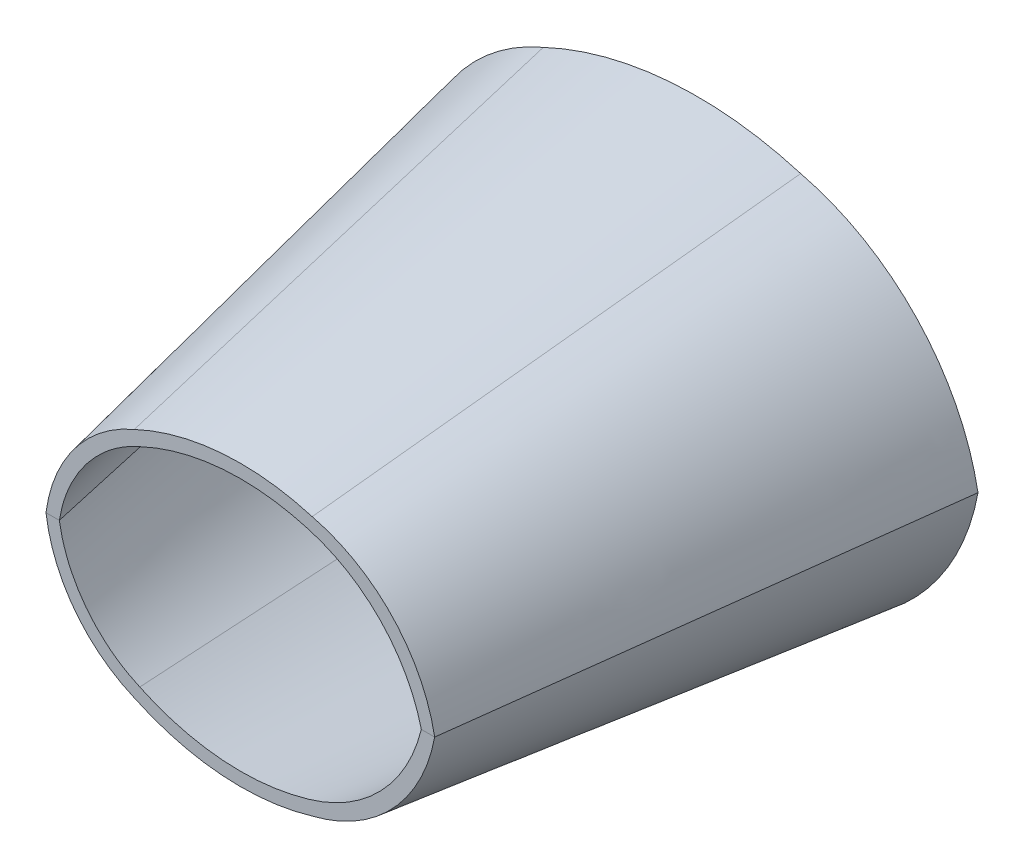
ISO-10303-21;
HEADER;
FILE_DESCRIPTION(('STEP AP214'),'2;1');
FILE_NAME('part.step','',(''),(''),'','','');
FILE_SCHEMA(('AUTOMOTIVE_DESIGN { 1 0 10303 214 1 1 1 1 }'));
ENDSEC;
DATA;
#1=APPLICATION_CONTEXT('core data for automotive mechanical design processes');
#2=APPLICATION_PROTOCOL_DEFINITION('international standard','automotive_design',2000,#1);
#3=PRODUCT_CONTEXT('',#1,'mechanical');
#4=PRODUCT('Part','Part','',(#3));
#5=PRODUCT_RELATED_PRODUCT_CATEGORY('part','',(#4));
#6=PRODUCT_DEFINITION_FORMATION('','',#4);
#7=PRODUCT_DEFINITION_CONTEXT('part definition',#1,'design');
#8=PRODUCT_DEFINITION('design','',#6,#7);
#9=PRODUCT_DEFINITION_SHAPE('','',#8);
#10=(LENGTH_UNIT() NAMED_UNIT(*) SI_UNIT(.MILLI.,.METRE.));
#11=(NAMED_UNIT(*) PLANE_ANGLE_UNIT() SI_UNIT($,.RADIAN.));
#12=(NAMED_UNIT(*) SI_UNIT($,.STERADIAN.) SOLID_ANGLE_UNIT());
#13=UNCERTAINTY_MEASURE_WITH_UNIT(LENGTH_MEASURE(1.E-05),#10,'distance_accuracy_value','');
#14=(GEOMETRIC_REPRESENTATION_CONTEXT(3) GLOBAL_UNCERTAINTY_ASSIGNED_CONTEXT((#13)) GLOBAL_UNIT_ASSIGNED_CONTEXT((#10,
#11,#12)) REPRESENTATION_CONTEXT('',''));
#15=CARTESIAN_POINT('',(0.,0.,0.));
#16=DIRECTION('',(0.,0.,1.));
#17=DIRECTION('',(1.,0.,0.));
#18=AXIS2_PLACEMENT_3D('',#15,#16,#17);
#19=CARTESIAN_POINT('',(-12.6687048152784,-8.00955853902853,0.));
#20=DIRECTION('',(0.,0.,-1.));
#21=DIRECTION('',(-1.,0.,0.));
#22=AXIS2_PLACEMENT_3D('',#19,#20,#21);
#23=PLANE('',#22);
#24=CARTESIAN_POINT('',(-12.6687048152784,-8.00955853902853,0.));
#25=DIRECTION('',(0.,0.,-1.));
#26=DIRECTION('',(-1.,0.,0.));
#27=AXIS2_PLACEMENT_3D('',#24,#25,#26);
#28=CIRCLE('',#27,38.1);
#29=CARTESIAN_POINT('',(-50.29,-1.988915,0.));
#30=VERTEX_POINT('',#29);
#31=CARTESIAN_POINT('',(-27.97978557,26.87855987,0.));
#32=VERTEX_POINT('',#31);
#33=EDGE_CURVE('E415',#30,#32,#28,.T.);
#34=ORIENTED_EDGE('',*,*,#33,.F.);
#35=DIRECTION('',(1.,0.,0.));
#36=VECTOR('',#35,1.);
#37=CARTESIAN_POINT('',(-53.99,-1.988915,0.));
#38=LINE('',#37,#36);
#39=CARTESIAN_POINT('',(-53.99,-1.9889151,0.));
#40=VERTEX_POINT('',#39);
#41=EDGE_CURVE('E12',#40,#30,#38,.T.);
#42=ORIENTED_EDGE('',*,*,#41,.F.);
#43=CARTESIAN_POINT('',(-13.7108054098462,-7.16178491606446,0.));
#44=DIRECTION('',(0.,0.,1.));
#45=DIRECTION('',(-1.,0.,0.));
#46=AXIS2_PLACEMENT_3D('',#43,#44,#45);
#47=CIRCLE('',#46,40.61);
#48=CARTESIAN_POINT('',(-29.4869285,30.25861113,0.));
#49=VERTEX_POINT('',#48);
#50=EDGE_CURVE('E220',#49,#40,#47,.T.);
#51=ORIENTED_EDGE('',*,*,#50,.F.);
#52=CARTESIAN_POINT('',(0.0239219679980442,-32.3996469423041,0.));
#53=DIRECTION('',(0.,0.,1.));
#54=DIRECTION('',(-1.,0.,0.));
#55=AXIS2_PLACEMENT_3D('',#52,#53,#54);
#56=CIRCLE('',#55,69.26);
#57=CARTESIAN_POINT('',(19.81935991,33.97119181,0.));
#58=VERTEX_POINT('',#57);
#59=EDGE_CURVE('E958',#58,#49,#56,.T.);
#60=ORIENTED_EDGE('',*,*,#59,.F.);
#61=CARTESIAN_POINT('',(9.06066667413897,-10.2179575352481,0.));
#62=DIRECTION('',(0.,0.,1.));
#63=DIRECTION('',(-1.,0.,0.));
#64=AXIS2_PLACEMENT_3D('',#61,#62,#63);
#65=CIRCLE('',#64,45.48);
#66=CARTESIAN_POINT('',(53.79,-1.98891504999999,0.));
#67=VERTEX_POINT('',#66);
#68=EDGE_CURVE('E915',#67,#58,#65,.T.);
#69=ORIENTED_EDGE('',*,*,#68,.F.);
#70=DIRECTION('',(1.,0.,0.));
#71=VECTOR('',#70,1.);
#72=CARTESIAN_POINT('',(50.09,-1.98891505,0.));
#73=LINE('',#72,#71);
#74=CARTESIAN_POINT('',(50.09,-1.98891505,0.));
#75=VERTEX_POINT('',#74);
#76=EDGE_CURVE('E874',#75,#67,#73,.T.);
#77=ORIENTED_EDGE('',*,*,#76,.F.);
#78=CARTESIAN_POINT('',(6.60314094344316,-12.6726170954129,0.));
#79=DIRECTION('',(0.,0.,-1.));
#80=DIRECTION('',(-1.,0.,0.));
#81=AXIS2_PLACEMENT_3D('',#78,#79,#80);
#82=CIRCLE('',#81,44.78);
#83=CARTESIAN_POINT('',(18.7964615473141,30.4455978823664,0.));
#84=VERTEX_POINT('',#83);
#85=EDGE_CURVE('E234',#84,#75,#82,.T.);
#86=ORIENTED_EDGE('',*,*,#85,.F.);
#87=CARTESIAN_POINT('',(0.0239231317043301,-32.399647752617,0.));
#88=DIRECTION('',(0.,0.,-1.));
#89=DIRECTION('',(-1.,0.,0.));
#90=AXIS2_PLACEMENT_3D('',#87,#88,#89);
#91=CIRCLE('',#90,65.56);
#92=EDGE_CURVE('E228',#32,#84,#91,.T.);
#93=ORIENTED_EDGE('',*,*,#92,.F.);
#94=EDGE_LOOP('',(#34,#42,#51,#60,#69,#77,#86,#93));
#95=FACE_BOUND('',#94,.T.);
#96=ADVANCED_FACE('F210',(#95),#23,.T.);
#97=CARTESIAN_POINT('',(-3.61942943832231,-6.1515091110409,92.59));
#98=DIRECTION('',(0.,0.,1.));
#99=DIRECTION('',(1.,0.,0.));
#100=AXIS2_PLACEMENT_3D('',#97,#98,#99);
#101=PLANE('',#100);
#102=CARTESIAN_POINT('',(-3.61942943832231,-6.1515091110409,92.59));
#103=DIRECTION('',(0.,0.,-1.));
#104=DIRECTION('',(1.,0.,0.));
#105=AXIS2_PLACEMENT_3D('',#102,#103,#104);
#106=CIRCLE('',#105,26.3217984327224);
#107=CARTESIAN_POINT('',(-29.61,-1.9889,92.59));
#108=VERTEX_POINT('',#107);
#109=CARTESIAN_POINT('',(-14.2002768194766,17.95,92.59));
#110=VERTEX_POINT('',#109);
#111=EDGE_CURVE('E495',#108,#110,#106,.T.);
#112=ORIENTED_EDGE('',*,*,#111,.T.);
#113=CARTESIAN_POINT('',(5.1428605077266,-23.0040899052184,92.59));
#114=DIRECTION('',(0.,0.,-1.));
#115=DIRECTION('',(1.,0.,0.));
#116=AXIS2_PLACEMENT_3D('',#113,#114,#115);
#117=CIRCLE('',#116,45.2923221045659);
#118=CARTESIAN_POINT('',(18.1166461409944,20.4115322582096,92.59));
#119=VERTEX_POINT('',#118);
#120=EDGE_CURVE('E664',#110,#119,#117,.T.);
#121=ORIENTED_EDGE('',*,*,#120,.T.);
#122=CARTESIAN_POINT('',(9.69295129625454,-9.38080114975129,92.59));
#123=DIRECTION('',(0.,0.,-1.));
#124=DIRECTION('',(1.,0.,0.));
#125=AXIS2_PLACEMENT_3D('',#122,#123,#124);
#126=CIRCLE('',#125,30.9400075828146);
#127=CARTESIAN_POINT('',(39.7369834260624,-1.9889,92.59));
#128=VERTEX_POINT('',#127);
#129=EDGE_CURVE('E663',#119,#128,#126,.T.);
#130=ORIENTED_EDGE('',*,*,#129,.T.);
#131=DIRECTION('',(1.,0.,0.));
#132=VECTOR('',#131,1.);
#133=CARTESIAN_POINT('',(39.7369834260624,-1.9889,92.59));
#134=LINE('',#133,#132);
#135=CARTESIAN_POINT('',(42.2937504675306,-1.9889,92.59));
#136=VERTEX_POINT('',#135);
#137=EDGE_CURVE('E420',#128,#136,#134,.T.);
#138=ORIENTED_EDGE('',*,*,#137,.T.);
#139=CARTESIAN_POINT('',(11.3901153445154,-7.68546373703139,92.59));
#140=DIRECTION('',(0.,0.,1.));
#141=DIRECTION('',(1.,0.,0.));
#142=AXIS2_PLACEMENT_3D('',#139,#140,#141);
#143=CIRCLE('',#142,31.4242820479088);
#144=CARTESIAN_POINT('',(18.82476412,22.8466750647576,92.59));
#145=VERTEX_POINT('',#144);
#146=EDGE_CURVE('E417',#136,#145,#143,.T.);
#147=ORIENTED_EDGE('',*,*,#146,.T.);
#148=CARTESIAN_POINT('',(5.1428605077266,-23.0040899052184,92.59));
#149=DIRECTION('',(0.,0.,1.));
#150=DIRECTION('',(1.,0.,0.));
#151=AXIS2_PLACEMENT_3D('',#148,#149,#150);
#152=CIRCLE('',#151,47.8485855045634);
#153=CARTESIAN_POINT('',(-15.248018320997,20.28215728,92.59));
#154=VERTEX_POINT('',#153);
#155=EDGE_CURVE('E421',#145,#154,#152,.T.);
#156=ORIENTED_EDGE('',*,*,#155,.T.);
#157=CARTESIAN_POINT('',(-4.33820298576542,-5.56733880887085,92.59));
#158=DIRECTION('',(0.,0.,1.));
#159=DIRECTION('',(1.,0.,0.));
#160=AXIS2_PLACEMENT_3D('',#157,#158,#159);
#161=CIRCLE('',#160,28.0574503242437);
#162=CARTESIAN_POINT('',(-32.1665211956136,-1.9889,92.59));
#163=VERTEX_POINT('',#162);
#164=EDGE_CURVE('E1071',#154,#163,#161,.T.);
#165=ORIENTED_EDGE('',*,*,#164,.T.);
#166=DIRECTION('',(1.,0.,0.));
#167=VECTOR('',#166,1.);
#168=CARTESIAN_POINT('',(-32.1665211956136,-1.9889,92.59));
#169=LINE('',#168,#167);
#170=EDGE_CURVE('E335',#163,#108,#169,.T.);
#171=ORIENTED_EDGE('',*,*,#170,.T.);
#172=EDGE_LOOP('',(#112,#121,#130,#138,#147,#156,#165,#171));
#173=FACE_BOUND('',#172,.T.);
#174=ADVANCED_FACE('F439',(#173),#101,.T.);
#175=CARTESIAN_POINT('',(39.7369834260624,-1.9889,92.59));
#176=CARTESIAN_POINT('',(50.09,-1.98891505,0.));
#177=CARTESIAN_POINT('',(39.0876927518456,0.650111193813457,92.59));
#178=CARTESIAN_POINT('',(49.1513931373978,1.83158314154442,0.));
#179=CARTESIAN_POINT('',(37.0901373759724,5.75577077587689,92.5900000000002));
#180=CARTESIAN_POINT('',(46.2619130833248,9.2239682643585,0.));
#181=CARTESIAN_POINT('',(32.2018850965432,12.3689043252988,92.5899999999997));
#182=CARTESIAN_POINT('',(39.1868978579355,18.8002214509162,0.));
#183=CARTESIAN_POINT('',(25.7603027933933,17.4811018099012,92.5900000000002));
#184=CARTESIAN_POINT('',(29.8617303065953,26.2030395408045,0.));
#185=CARTESIAN_POINT('',(20.7261606098027,19.6525989254854,92.59));
#186=CARTESIAN_POINT('',(22.5739836849416,29.3471136438534,0.));
#187=CARTESIAN_POINT('',(15.4652540075852,21.182645004362,92.59));
#188=CARTESIAN_POINT('',(14.9583175840107,31.5617106396779,0.));
#189=CARTESIAN_POINT('',(10.028650471628,22.2788342824319,92.5900000000001));
#190=CARTESIAN_POINT('',(7.08884994158403,33.1474515118353,0.));
#191=CARTESIAN_POINT('',(1.71040057532654,22.4119901309893,92.5899999999999));
#192=CARTESIAN_POINT('',(-4.95069886457837,33.3389612687194,0.));
#193=CARTESIAN_POINT('',(-6.49334759040789,21.0301334631204,92.5900000000001));
#194=CARTESIAN_POINT('',(-16.8243279031502,31.3378753391965,0.));
#195=CARTESIAN_POINT('',(-11.7034409566889,19.1292873212215,92.59));
#196=CARTESIAN_POINT('',(-24.3655534885248,28.5859647739123,0.));
#197=CARTESIAN_POINT('',(-14.2002768194766,17.95,92.59));
#198=CARTESIAN_POINT('',(-27.97978557,26.87855987,0.));
#199=B_SPLINE_SURFACE_WITH_KNOTS('',3,1,((#175,#176),(#177,#178),(#179,#180),(#181,#182),(#183,
#184),(#185,#186),(#187,#188),(#189,#190),(#191,#192),(#193,#194),(#195,#196),(#197,#198)),
.UNSPECIFIED.,.F.,.F.,.F.,(4,1,1,1,2,1,1,1,4),(2,2),(0.,0.124005034859471,0.248010069718941,
0.372015104578412,0.496020139437883,0.622015104578412,0.748010069718941,0.874005034859471,1.),
(0.,1.),.UNSPECIFIED.);
#200=DIRECTION('',(-0.146536612626972,0.0949497505807106,-0.984637784174705));
#201=VECTOR('',#200,1.);
#202=CARTESIAN_POINT('',(-21.0900311947383,22.414279935,46.295));
#203=LINE('',#202,#201);
#204=EDGE_CURVE('E820',#110,#32,#203,.T.);
#205=DIRECTION('',(0.111123194774175,-1.61537854148646E-07,-0.993806638930911));
#206=VECTOR('',#205,1.);
#207=CARTESIAN_POINT('',(44.9134917130312,-1.988907525,46.295));
#208=LINE('',#207,#206);
#209=EDGE_CURVE('E662',#128,#75,#208,.T.);
#210=ORIENTED_EDGE('',*,*,#129,.F.);
#211=ORIENTED_EDGE('',*,*,#120,.F.);
#212=ORIENTED_EDGE('',*,*,#204,.T.);
#213=ORIENTED_EDGE('',*,*,#92,.T.);
#214=ORIENTED_EDGE('',*,*,#85,.T.);
#215=ORIENTED_EDGE('',*,*,#209,.F.);
#216=EDGE_LOOP('',(#210,#211,#212,#213,#214,#215));
#217=FACE_BOUND('',#216,.T.);
#218=ADVANCED_FACE('F449',(#217),#199,.T.);
#219=CARTESIAN_POINT('',(18.82476412,22.8466750647576,92.59));
#220=CARTESIAN_POINT('',(19.81935991,33.97119181,0.));
#221=CARTESIAN_POINT('',(30.8560345794609,19.9170319509999,92.59));
#222=CARTESIAN_POINT('',(37.2382677852626,29.7302256653592,0.));
#223=CARTESIAN_POINT('',(40.0490043835856,10.1887595724013,92.59));
#224=CARTESIAN_POINT('',(50.546196145976,15.6429277908234,0.));
#225=CARTESIAN_POINT('',(42.2937504675306,-1.9889,92.59));
#226=CARTESIAN_POINT('',(53.79,-1.98891505000001,0.));
#227=B_SPLINE_SURFACE_WITH_KNOTS('',3,1,((#219,#220),(#221,#222),(#223,#224),(#225,#226)),
.UNSPECIFIED.,.F.,.F.,.F.,(4,4),(2,2),(0.,1.),(0.,1.),.UNSPECIFIED.);
#228=DIRECTION('',(-0.12321682155022,1.61305924950369E-07,0.992379773517697));
#229=VECTOR('',#228,1.);
#230=CARTESIAN_POINT('',(48.0418752337653,-1.988907525,46.295));
#231=LINE('',#230,#229);
#232=EDGE_CURVE('E673',#67,#136,#231,.T.);
#233=DIRECTION('',(0.0106646252254914,0.119283434632988,-0.992802965341541));
#234=VECTOR('',#233,1.);
#235=CARTESIAN_POINT('',(19.322062015,28.4089334373788,46.295));
#236=LINE('',#235,#234);
#237=EDGE_CURVE('E748',#145,#58,#236,.T.);
#238=ORIENTED_EDGE('',*,*,#146,.F.);
#239=ORIENTED_EDGE('',*,*,#232,.F.);
#240=ORIENTED_EDGE('',*,*,#68,.T.);
#241=ORIENTED_EDGE('',*,*,#237,.F.);
#242=EDGE_LOOP('',(#238,#239,#240,#241));
#243=FACE_BOUND('',#242,.T.);
#244=ADVANCED_FACE('F775',(#243),#227,.T.);
#245=CARTESIAN_POINT('',(-14.2002768194766,17.95,92.59));
#246=CARTESIAN_POINT('',(-27.97978557,26.87855987,0.));
#247=CARTESIAN_POINT('',(-22.3904330287203,14.3544246159622,92.59));
#248=CARTESIAN_POINT('',(-39.8385073743326,21.6742136491695,0.));
#249=CARTESIAN_POINT('',(-28.1954653872347,6.84319561222022,92.59));
#250=CARTESIAN_POINT('',(-48.243540056952,10.7988332036645,0.));
#251=CARTESIAN_POINT('',(-29.61,-1.98890000000001,92.59));
#252=CARTESIAN_POINT('',(-50.29,-1.988915,0.));
#253=B_SPLINE_SURFACE_WITH_KNOTS('',3,1,((#245,#246),(#247,#248),(#249,#250),(#251,#252)),
.UNSPECIFIED.,.F.,.F.,.F.,(4,4),(2,2),(0.,1.),(0.,1.),.UNSPECIFIED.);
#254=DIRECTION('',(-0.217979431413439,-1.58108871831749E-07,-0.975953363373808));
#255=VECTOR('',#254,1.);
#256=CARTESIAN_POINT('',(-39.95,-1.9889075,46.295));
#257=LINE('',#256,#255);
#258=EDGE_CURVE('E529',#108,#30,#257,.T.);
#259=ORIENTED_EDGE('',*,*,#111,.F.);
#260=ORIENTED_EDGE('',*,*,#258,.T.);
#261=ORIENTED_EDGE('',*,*,#33,.T.);
#262=ORIENTED_EDGE('',*,*,#204,.F.);
#263=EDGE_LOOP('',(#259,#260,#261,#262));
#264=FACE_BOUND('',#263,.T.);
#265=ADVANCED_FACE('F721',(#264),#253,.T.);
#266=CARTESIAN_POINT('',(-32.1665211956136,-1.98889999999999,92.59));
#267=CARTESIAN_POINT('',(-53.99,-1.98891499999998,0.));
#268=CARTESIAN_POINT('',(-30.8929291484628,7.91539811732063,92.59));
#269=CARTESIAN_POINT('',(-52.1479192319075,12.3546758717429,0.));
#270=CARTESIAN_POINT('',(-24.4480394475373,16.3992757249512,92.59));
#271=CARTESIAN_POINT('',(-42.8124891673561,24.6406672398623,0.));
#272=CARTESIAN_POINT('',(-15.248018320997,20.28215728,92.59));
#273=CARTESIAN_POINT('',(-29.4869285,30.25861113,0.));
#274=B_SPLINE_SURFACE_WITH_KNOTS('',3,1,((#266,#267),(#268,#269),(#270,#271),(#272,#273)),
.UNSPECIFIED.,.F.,.F.,.F.,(4,4),(2,2),(0.,1.),(0.,1.),.UNSPECIFIED.);
#275=DIRECTION('',(-0.151143007748895,0.105897938999614,-0.982823187416868));
#276=VECTOR('',#275,1.);
#277=CARTESIAN_POINT('',(-22.3674734104985,25.270384205,46.295));
#278=LINE('',#277,#276);
#279=EDGE_CURVE('E741',#154,#49,#278,.T.);
#280=DIRECTION('',(-0.229413806952256,-1.57683710058716E-07,-0.97332898096155));
#281=VECTOR('',#280,1.);
#282=CARTESIAN_POINT('',(-43.0782605978068,-1.9889075,46.295));
#283=LINE('',#282,#281);
#284=EDGE_CURVE('E749',#163,#40,#283,.T.);
#285=ORIENTED_EDGE('',*,*,#164,.F.);
#286=ORIENTED_EDGE('',*,*,#279,.T.);
#287=ORIENTED_EDGE('',*,*,#50,.T.);
#288=ORIENTED_EDGE('',*,*,#284,.F.);
#289=EDGE_LOOP('',(#285,#286,#287,#288));
#290=FACE_BOUND('',#289,.T.);
#291=ADVANCED_FACE('F710',(#290),#274,.T.);
#292=CARTESIAN_POINT('',(-15.248018320997,20.28215728,92.59));
#293=CARTESIAN_POINT('',(-29.4869285,30.25861113,0.));
#294=CARTESIAN_POINT('',(-4.59354085145598,25.3011684715954,92.59));
#295=CARTESIAN_POINT('',(-14.0686981547171,37.5203050263695,0.));
#296=CARTESIAN_POINT('',(7.53905620811963,26.2143390055387,92.59));
#297=CARTESIAN_POINT('',(3.48758000459961,38.8422276696842,0.));
#298=CARTESIAN_POINT('',(18.82476412,22.8466750647576,92.59));
#299=CARTESIAN_POINT('',(19.81935991,33.97119181,0.));
#300=B_SPLINE_SURFACE_WITH_KNOTS('',3,1,((#292,#293),(#294,#295),(#296,#297),(#298,#299)),
.UNSPECIFIED.,.F.,.F.,.F.,(4,4),(2,2),(0.,1.),(0.,1.),.UNSPECIFIED.);
#301=ORIENTED_EDGE('',*,*,#155,.F.);
#302=ORIENTED_EDGE('',*,*,#237,.T.);
#303=ORIENTED_EDGE('',*,*,#59,.T.);
#304=ORIENTED_EDGE('',*,*,#279,.F.);
#305=EDGE_LOOP('',(#301,#302,#303,#304));
#306=FACE_BOUND('',#305,.T.);
#307=ADVANCED_FACE('F720',(#306),#300,.T.);
#308=CARTESIAN_POINT('',(-12.6687048152784,4.03172843902821,-1.95724558825224E-06));
#309=DIRECTION('',(0.,-3.25089102488621E-07,-0.999999999999947));
#310=DIRECTION('',(-1.,0.,0.));
#311=AXIS2_PLACEMENT_3D('',#308,#309,#310);
#312=PLANE('',#311);
#313=CARTESIAN_POINT('',(-12.6687048152784,4.03172843902821,-1.95724558825224E-06));
#314=DIRECTION('',(0.,3.25089102488621E-07,0.999999999999947));
#315=DIRECTION('',(-1.,0.,0.));
#316=AXIS2_PLACEMENT_3D('',#313,#314,#315);
#317=CIRCLE('',#316,38.1);
#318=CARTESIAN_POINT('',(-27.97978557,-30.8563899699985,9.38450151285559E-06));
#319=VERTEX_POINT('',#318);
#320=EDGE_CURVE('E410',#30,#319,#317,.T.);
#321=ORIENTED_EDGE('',*,*,#320,.T.);
#322=CARTESIAN_POINT('',(0.0239231317043301,28.4218176526154,-9.88619780031514E-06));
#323=DIRECTION('',(0.,3.25089102488621E-07,0.999999999999947));
#324=DIRECTION('',(-1.,0.,0.));
#325=AXIS2_PLACEMENT_3D('',#322,#323,#324);
#326=CIRCLE('',#325,65.56);
#327=CARTESIAN_POINT('',(18.7964615473141,-34.4234279823646,1.05441066988386E-05));
#328=VERTEX_POINT('',#327);
#329=EDGE_CURVE('E414',#319,#328,#326,.T.);
#330=ORIENTED_EDGE('',*,*,#329,.T.);
#331=CARTESIAN_POINT('',(6.60314094344316,8.69478699541237,-3.47315510919914E-06));
#332=DIRECTION('',(0.,3.25089102488621E-07,0.999999999999947));
#333=DIRECTION('',(-1.,0.,0.));
#334=AXIS2_PLACEMENT_3D('',#331,#332,#333);
#335=CIRCLE('',#334,44.78);
#336=EDGE_CURVE('E591',#328,#75,#335,.T.);
#337=ORIENTED_EDGE('',*,*,#336,.T.);
#338=ORIENTED_EDGE('',*,*,#76,.T.);
#339=CARTESIAN_POINT('',(9.06066667413897,6.24012743524764,-2.67517203587003E-06));
#340=DIRECTION('',(0.,-3.25089102488621E-07,-0.999999999999947));
#341=DIRECTION('',(-1.,0.,0.));
#342=AXIS2_PLACEMENT_3D('',#339,#340,#341);
#343=CIRCLE('',#342,45.48);
#344=CARTESIAN_POINT('',(19.81935991,-37.9490219099981,1.16902388645123E-05));
#345=VERTEX_POINT('',#344);
#346=EDGE_CURVE('E605',#67,#345,#343,.T.);
#347=ORIENTED_EDGE('',*,*,#346,.T.);
#348=CARTESIAN_POINT('',(0.0239219679980442,28.4218168423025,-9.88619753689123E-06));
#349=DIRECTION('',(0.,-3.25089102488621E-07,-0.999999999999947));
#350=DIRECTION('',(-1.,0.,0.));
#351=AXIS2_PLACEMENT_3D('',#348,#349,#350);
#352=CIRCLE('',#351,69.26);
#353=CARTESIAN_POINT('',(-29.4869285,-34.2364412299983,1.04833193433345E-05));
#354=VERTEX_POINT('',#353);
#355=EDGE_CURVE('E844',#345,#354,#352,.T.);
#356=ORIENTED_EDGE('',*,*,#355,.T.);
#357=CARTESIAN_POINT('',(-13.7108054098462,3.18395481606418,-1.68164362204933E-06));
#358=DIRECTION('',(0.,-3.25089102488621E-07,-0.999999999999947));
#359=DIRECTION('',(-1.,0.,0.));
#360=AXIS2_PLACEMENT_3D('',#357,#358,#359);
#361=CIRCLE('',#360,40.61);
#362=EDGE_CURVE('E312',#354,#40,#361,.T.);
#363=ORIENTED_EDGE('',*,*,#362,.T.);
#364=ORIENTED_EDGE('',*,*,#41,.T.);
#365=EDGE_LOOP('',(#321,#330,#337,#338,#347,#356,#363,#364));
#366=FACE_BOUND('',#365,.T.);
#367=ADVANCED_FACE('F355',(#366),#312,.T.);
#368=CARTESIAN_POINT('',(-3.61942943832231,2.17370911104068,92.5899986467812));
#369=DIRECTION('',(0.,3.25089102488621E-07,0.999999999999947));
#370=DIRECTION('',(1.,0.,0.));
#371=AXIS2_PLACEMENT_3D('',#368,#369,#370);
#372=PLANE('',#371);
#373=CARTESIAN_POINT('',(-3.61942943832231,2.17370911104068,92.5899986467812));
#374=DIRECTION('',(0.,3.25089102488621E-07,0.999999999999947));
#375=DIRECTION('',(1.,0.,0.));
#376=AXIS2_PLACEMENT_3D('',#373,#374,#375);
#377=CIRCLE('',#376,26.3217984327224);
#378=CARTESIAN_POINT('',(-14.2002768194766,-21.927799999999,92.5900064819191));
#379=VERTEX_POINT('',#378);
#380=EDGE_CURVE('E337',#108,#379,#377,.T.);
#381=ORIENTED_EDGE('',*,*,#380,.F.);
#382=ORIENTED_EDGE('',*,*,#170,.F.);
#383=CARTESIAN_POINT('',(-4.33820298576542,1.58953880887066,92.5899988366886));
#384=DIRECTION('',(0.,-3.25089102488621E-07,-0.999999999999947));
#385=DIRECTION('',(1.,0.,0.));
#386=AXIS2_PLACEMENT_3D('',#383,#384,#385);
#387=CIRCLE('',#386,28.0574503242437);
#388=CARTESIAN_POINT('',(-15.248018320997,-24.2599572799988,92.590007240078));
#389=VERTEX_POINT('',#388);
#390=EDGE_CURVE('E308',#389,#163,#387,.T.);
#391=ORIENTED_EDGE('',*,*,#390,.F.);
#392=CARTESIAN_POINT('',(5.1428605077266,19.0262899052173,92.5899931681908));
#393=DIRECTION('',(0.,-3.25089102488621E-07,-0.999999999999947));
#394=DIRECTION('',(1.,0.,0.));
#395=AXIS2_PLACEMENT_3D('',#392,#393,#394);
#396=CIRCLE('',#395,47.8485855045634);
#397=CARTESIAN_POINT('',(18.82476412,-26.8244750647563,92.5900080737748));
#398=VERTEX_POINT('',#397);
#399=EDGE_CURVE('E321',#398,#389,#396,.T.);
#400=ORIENTED_EDGE('',*,*,#399,.F.);
#401=CARTESIAN_POINT('',(11.3901153445154,3.70766373703109,92.5899981481092));
#402=DIRECTION('',(0.,-3.25089102488621E-07,-0.999999999999947));
#403=DIRECTION('',(1.,0.,0.));
#404=AXIS2_PLACEMENT_3D('',#401,#402,#403);
#405=CIRCLE('',#404,31.4242820479088);
#406=EDGE_CURVE('E328',#136,#398,#405,.T.);
#407=ORIENTED_EDGE('',*,*,#406,.F.);
#408=ORIENTED_EDGE('',*,*,#137,.F.);
#409=CARTESIAN_POINT('',(9.69295129625454,5.4030011497509,92.5899975969735));
#410=DIRECTION('',(0.,3.25089102488621E-07,0.999999999999947));
#411=DIRECTION('',(1.,0.,0.));
#412=AXIS2_PLACEMENT_3D('',#409,#410,#411);
#413=CIRCLE('',#412,30.9400075828146);
#414=CARTESIAN_POINT('',(18.1166461409944,-24.3893322582084,92.5900072821364));
#415=VERTEX_POINT('',#414);
#416=EDGE_CURVE('E214',#415,#128,#413,.T.);
#417=ORIENTED_EDGE('',*,*,#416,.F.);
#418=CARTESIAN_POINT('',(5.1428605077266,19.0262899052173,92.5899931681908));
#419=DIRECTION('',(0.,3.25089102488621E-07,0.999999999999947));
#420=DIRECTION('',(1.,0.,0.));
#421=AXIS2_PLACEMENT_3D('',#418,#419,#420);
#422=CIRCLE('',#421,45.2923221045659);
#423=EDGE_CURVE('E517',#379,#415,#422,.T.);
#424=ORIENTED_EDGE('',*,*,#423,.F.);
#425=EDGE_LOOP('',(#381,#382,#391,#400,#407,#408,#417,#424));
#426=FACE_BOUND('',#425,.T.);
#427=ADVANCED_FACE('F334',(#426),#372,.T.);
#428=CARTESIAN_POINT('',(39.7369834260624,-1.98890000000001,92.59));
#429=CARTESIAN_POINT('',(50.09,-1.98891505,0.));
#430=CARTESIAN_POINT('',(39.0876927518456,-4.62791119381332,92.5900008579138));
#431=CARTESIAN_POINT('',(49.1513931373978,-5.80941324154422,1.24200232814858E-06));
#432=CARTESIAN_POINT('',(37.0901373759724,-9.73357077587648,92.5900025177083));
#433=CARTESIAN_POINT('',(46.2619130833248,-13.2017983643579,3.64518617297444E-06));
#434=CARTESIAN_POINT('',(32.2018850965432,-16.346704325298,92.5900046675654));
#435=CARTESIAN_POINT('',(39.1868978579355,-22.7780515509151,6.75832172659628E-06));
#436=CARTESIAN_POINT('',(25.7603027933933,-21.4589018099002,92.5900063294856));
#437=CARTESIAN_POINT('',(29.8617303065953,-30.180869640803,9.16489721532461E-06));
#438=CARTESIAN_POINT('',(20.7261606098027,-23.6303989254843,92.5900070354155));
#439=CARTESIAN_POINT('',(22.5739836849416,-33.3249437438518,1.01870014436425E-05));
#440=CARTESIAN_POINT('',(15.4652540075852,-25.1604450043608,92.5900075328168));
#441=CARTESIAN_POINT('',(14.9583175840107,-35.5395407396761,1.09069427933891E-05));
#442=CARTESIAN_POINT('',(10.028650471628,-26.2566342824306,92.590007889176));
#443=CARTESIAN_POINT('',(7.08884994158403,-37.1252816118335,1.14224498702983E-05));
#444=CARTESIAN_POINT('',(1.71040057532654,-26.389790130988,92.5900079324634));
#445=CARTESIAN_POINT('',(-4.95069886457837,-37.3167913687175,1.14847076052815E-05));
#446=CARTESIAN_POINT('',(-6.49334759040789,-25.0079334631191,92.590007483237));
#447=CARTESIAN_POINT('',(-16.8243279031502,-35.3157054391947,1.08341763764503E-05));
#448=CARTESIAN_POINT('',(-11.7034409566889,-23.1070873212204,92.5900068652926));
#449=CARTESIAN_POINT('',(-24.3655534885248,-32.5637948739107,9.9395602406531E-06));
#450=CARTESIAN_POINT('',(-14.2002768194766,-21.9277999999989,92.5900064819191));
#451=CARTESIAN_POINT('',(-27.97978557,-30.8563899699985,9.38450151285559E-06));
#452=B_SPLINE_SURFACE_WITH_KNOTS('',3,1,((#428,#429),(#430,#431),(#432,#433),(#434,#435),(#436,
#437),(#438,#439),(#440,#441),(#442,#443),(#444,#445),(#446,#447),(#448,#449),(#450,#451)),
.UNSPECIFIED.,.F.,.F.,.F.,(4,1,1,1,2,1,1,1,4),(2,2),(0.,0.124005034859471,0.248010069718941,
0.372015104578412,0.496020139437883,0.622015104578412,0.748010069718941,0.874005034859471,1.),
(0.,1.),.UNSPECIFIED.);
#453=DIRECTION('',(-0.146536612626972,-0.0949500706757191,-0.984637753307524));
#454=VECTOR('',#453,1.);
#455=CARTESIAN_POINT('',(-21.0900311947383,-26.3920949849987,46.2950079332103));
#456=LINE('',#455,#454);
#457=EDGE_CURVE('E318',#379,#319,#456,.T.);
#458=ORIENTED_EDGE('',*,*,#416,.T.);
#459=ORIENTED_EDGE('',*,*,#209,.T.);
#460=ORIENTED_EDGE('',*,*,#336,.F.);
#461=ORIENTED_EDGE('',*,*,#329,.F.);
#462=ORIENTED_EDGE('',*,*,#457,.F.);
#463=ORIENTED_EDGE('',*,*,#423,.T.);
#464=EDGE_LOOP('',(#458,#459,#460,#461,#462,#463));
#465=FACE_BOUND('',#464,.T.);
#466=ADVANCED_FACE('F354',(#465),#452,.F.);
#467=CARTESIAN_POINT('',(18.82476412,-26.8244750647563,92.5900080737748));
#468=CARTESIAN_POINT('',(19.81935991,-37.9490219099981,1.16902388645123E-05));
#469=CARTESIAN_POINT('',(30.8560345794609,-23.8948319509987,92.5900071213798));
#470=CARTESIAN_POINT('',(37.2382677852626,-33.7080557653575,1.03115469868664E-05));
#471=CARTESIAN_POINT('',(40.0490043835856,-14.1665595724007,92.5900039588244));
#472=CARTESIAN_POINT('',(50.546196145976,-19.6207578908224,5.73191996434369E-06));
#473=CARTESIAN_POINT('',(42.2937504675306,-1.9889,92.59));
#474=CARTESIAN_POINT('',(53.79,-1.98891505,0.));
#475=B_SPLINE_SURFACE_WITH_KNOTS('',3,1,((#467,#468),(#469,#470),(#471,#472),(#473,#474)),
.UNSPECIFIED.,.F.,.F.,.F.,(4,4),(2,2),(0.,1.),(0.,1.),.UNSPECIFIED.);
#476=DIRECTION('',(0.0106646252254914,-0.119283757382406,-0.992802926563744));
#477=VECTOR('',#476,1.);
#478=CARTESIAN_POINT('',(19.322062015,-32.3867484873772,46.2950098820068));
#479=LINE('',#478,#477);
#480=EDGE_CURVE('E317',#398,#345,#479,.T.);
#481=ORIENTED_EDGE('',*,*,#406,.T.);
#482=ORIENTED_EDGE('',*,*,#480,.T.);
#483=ORIENTED_EDGE('',*,*,#346,.F.);
#484=ORIENTED_EDGE('',*,*,#232,.T.);
#485=EDGE_LOOP('',(#481,#482,#483,#484));
#486=FACE_BOUND('',#485,.T.);
#487=ADVANCED_FACE('F548',(#486),#475,.F.);
#488=CARTESIAN_POINT('',(-14.2002768194766,-21.9277999999989,92.5900064819191));
#489=CARTESIAN_POINT('',(-27.97978557,-30.8563899699985,9.38450151285558E-06));
#490=CARTESIAN_POINT('',(-22.3904330287203,-18.3322246159614,92.5900053130367));
#491=CARTESIAN_POINT('',(-39.8385073743326,-25.6520437491683,7.69262527088576E-06));
#492=CARTESIAN_POINT('',(-28.1954653872347,-10.8209956122198,92.590002871218));
#493=CARTESIAN_POINT('',(-48.243540056952,-14.7766633036638,4.15715760263423E-06));
#494=CARTESIAN_POINT('',(-29.61,-1.98889999999999,92.59));
#495=CARTESIAN_POINT('',(-50.29,-1.9889151,0.));
#496=B_SPLINE_SURFACE_WITH_KNOTS('',3,1,((#488,#489),(#490,#491),(#492,#493),(#494,#495)),
.UNSPECIFIED.,.F.,.F.,.F.,(4,4),(2,2),(0.,1.),(0.,1.),.UNSPECIFIED.);
#497=ORIENTED_EDGE('',*,*,#380,.T.);
#498=ORIENTED_EDGE('',*,*,#457,.T.);
#499=ORIENTED_EDGE('',*,*,#320,.F.);
#500=ORIENTED_EDGE('',*,*,#258,.F.);
#501=EDGE_LOOP('',(#497,#498,#499,#500));
#502=FACE_BOUND('',#501,.T.);
#503=ADVANCED_FACE('F526',(#502),#496,.F.);
#504=CARTESIAN_POINT('',(-32.1665211956136,-1.98890000000001,92.59));
#505=CARTESIAN_POINT('',(-53.99,-1.98891510000002,0.));
#506=CARTESIAN_POINT('',(-30.8929291484628,-11.8931981173201,92.5900032197794));
#507=CARTESIAN_POINT('',(-52.1479192319075,-16.3325059717422,4.66294509921335E-06));
#508=CARTESIAN_POINT('',(-24.4480394475373,-20.3770757249502,92.5900059777955));
#509=CARTESIAN_POINT('',(-42.8124891673561,-28.6184973398609,8.65698700625821E-06));
#510=CARTESIAN_POINT('',(-15.248018320997,-24.2599572799988,92.590007240078));
#511=CARTESIAN_POINT('',(-29.4869285,-34.2364412299983,1.04833193433345E-05));
#512=B_SPLINE_SURFACE_WITH_KNOTS('',3,1,((#504,#505),(#506,#507),(#508,#509),(#510,#511)),
.UNSPECIFIED.,.F.,.F.,.F.,(4,4),(2,2),(0.,1.),(0.,1.),.UNSPECIFIED.);
#513=DIRECTION('',(-0.151143007748895,-0.105898258504716,-0.98282315299055));
#514=VECTOR('',#513,1.);
#515=CARTESIAN_POINT('',(-22.3674734104985,-29.2481992549986,46.2950088616987));
#516=LINE('',#515,#514);
#517=EDGE_CURVE('E303',#389,#354,#516,.T.);
#518=ORIENTED_EDGE('',*,*,#390,.T.);
#519=ORIENTED_EDGE('',*,*,#284,.T.);
#520=ORIENTED_EDGE('',*,*,#362,.F.);
#521=ORIENTED_EDGE('',*,*,#517,.F.);
#522=EDGE_LOOP('',(#518,#519,#520,#521));
#523=FACE_BOUND('',#522,.T.);
#524=ADVANCED_FACE('F305',(#523),#512,.F.);
#525=CARTESIAN_POINT('',(-15.248018320997,-24.2599572799988,92.590007240078));
#526=CARTESIAN_POINT('',(-29.4869285,-34.2364412299983,1.04833193433345E-05));
#527=CARTESIAN_POINT('',(-4.59354085145598,-29.278968471594,92.5900088717039));
#528=CARTESIAN_POINT('',(-14.0686981547171,-41.4981351263674,1.28440168946524E-05));
#529=CARTESIAN_POINT('',(7.53905620811963,-30.1921390055372,92.5900091685657));
#530=CARTESIAN_POINT('',(3.48758000459961,-42.820057769682,1.32737595403269E-05));
#531=CARTESIAN_POINT('',(18.82476412,-26.8244750647563,92.5900080737748));
#532=CARTESIAN_POINT('',(19.81935991,-37.9490219099981,1.16902388645123E-05));
#533=B_SPLINE_SURFACE_WITH_KNOTS('',3,1,((#525,#526),(#527,#528),(#529,#530),(#531,#532)),
.UNSPECIFIED.,.F.,.F.,.F.,(4,4),(2,2),(0.,1.),(0.,1.),.UNSPECIFIED.);
#534=ORIENTED_EDGE('',*,*,#399,.T.);
#535=ORIENTED_EDGE('',*,*,#517,.T.);
#536=ORIENTED_EDGE('',*,*,#355,.F.);
#537=ORIENTED_EDGE('',*,*,#480,.F.);
#538=EDGE_LOOP('',(#534,#535,#536,#537));
#539=FACE_BOUND('',#538,.T.);
#540=ADVANCED_FACE('F323',(#539),#533,.F.);
#541=CLOSED_SHELL('',(#96,#174,#218,#244,#265,#291,#307,#367,#427,#466,#487,#503,#524,#540));
#542=MANIFOLD_SOLID_BREP('B2',#541);
#543=ADVANCED_BREP_SHAPE_REPRESENTATION('',(#18,#542),#14);
#544=SHAPE_DEFINITION_REPRESENTATION(#9,#543);
ENDSEC;
END-ISO-10303-21;
